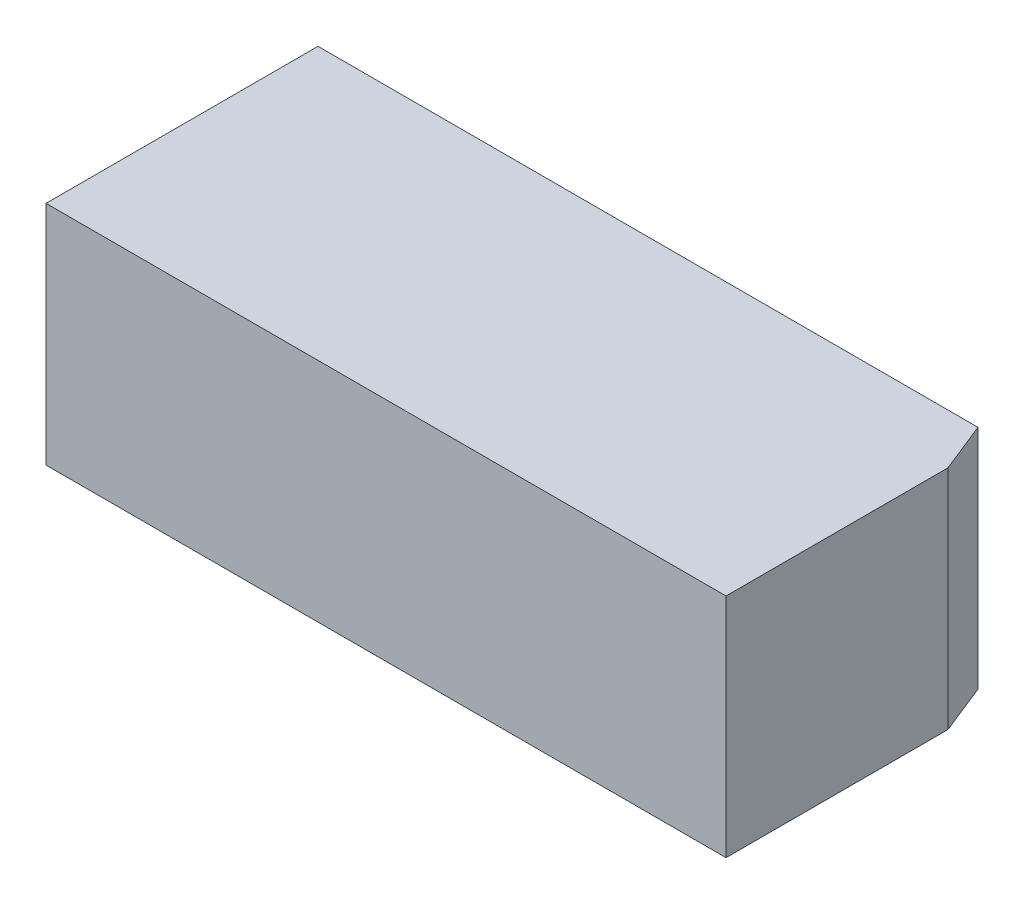
ISO-10303-21;
HEADER;
FILE_DESCRIPTION(('STEP AP214'),'2;1');
FILE_NAME('part.step','',(''),(''),'','','');
FILE_SCHEMA(('AUTOMOTIVE_DESIGN { 1 0 10303 214 1 1 1 1 }'));
ENDSEC;
DATA;
#1=APPLICATION_CONTEXT('core data for automotive mechanical design processes');
#2=APPLICATION_PROTOCOL_DEFINITION('international standard','automotive_design',2000,#1);
#3=PRODUCT_CONTEXT('',#1,'mechanical');
#4=PRODUCT('Part','Part','',(#3));
#5=PRODUCT_RELATED_PRODUCT_CATEGORY('part','',(#4));
#6=PRODUCT_DEFINITION_FORMATION('','',#4);
#7=PRODUCT_DEFINITION_CONTEXT('part definition',#1,'design');
#8=PRODUCT_DEFINITION('design','',#6,#7);
#9=PRODUCT_DEFINITION_SHAPE('','',#8);
#10=(LENGTH_UNIT() NAMED_UNIT(*) SI_UNIT(.MILLI.,.METRE.));
#11=(NAMED_UNIT(*) PLANE_ANGLE_UNIT() SI_UNIT($,.RADIAN.));
#12=(NAMED_UNIT(*) SI_UNIT($,.STERADIAN.) SOLID_ANGLE_UNIT());
#13=UNCERTAINTY_MEASURE_WITH_UNIT(LENGTH_MEASURE(1.E-05),#10,'distance_accuracy_value','');
#14=(GEOMETRIC_REPRESENTATION_CONTEXT(3) GLOBAL_UNCERTAINTY_ASSIGNED_CONTEXT((#13)) GLOBAL_UNIT_ASSIGNED_CONTEXT((#10,
#11,#12)) REPRESENTATION_CONTEXT('',''));
#15=CARTESIAN_POINT('',(0.,0.,0.));
#16=DIRECTION('',(0.,0.,1.));
#17=DIRECTION('',(1.,0.,0.));
#18=AXIS2_PLACEMENT_3D('',#15,#16,#17);
#19=CARTESIAN_POINT('',(-7.5,5.,-3.));
#20=DIRECTION('',(1.,0.,0.));
#21=DIRECTION('',(0.,0.,-1.));
#22=AXIS2_PLACEMENT_3D('',#19,#20,#21);
#23=PLANE('',#22);
#24=DIRECTION('',(0.,0.,1.));
#25=VECTOR('',#24,1.);
#26=CARTESIAN_POINT('',(-7.5,0.,-3.));
#27=LINE('',#26,#25);
#28=CARTESIAN_POINT('',(-7.5,0.,-3.));
#29=VERTEX_POINT('',#28);
#30=CARTESIAN_POINT('',(-7.5,0.,3.));
#31=VERTEX_POINT('',#30);
#32=EDGE_CURVE('E108',#29,#31,#27,.T.);
#33=ORIENTED_EDGE('',*,*,#32,.T.);
#34=DIRECTION('',(0.,-1.,0.));
#35=VECTOR('',#34,1.);
#36=CARTESIAN_POINT('',(-7.5,5.,3.));
#37=LINE('',#36,#35);
#38=CARTESIAN_POINT('',(-7.5,5.,3.));
#39=VERTEX_POINT('',#38);
#40=EDGE_CURVE('E11',#39,#31,#37,.T.);
#41=ORIENTED_EDGE('',*,*,#40,.F.);
#42=DIRECTION('',(0.,0.,1.));
#43=VECTOR('',#42,1.);
#44=CARTESIAN_POINT('',(-7.5,5.,-3.));
#45=LINE('',#44,#43);
#46=CARTESIAN_POINT('',(-7.5,5.,-3.));
#47=VERTEX_POINT('',#46);
#48=EDGE_CURVE('E104',#47,#39,#45,.T.);
#49=ORIENTED_EDGE('',*,*,#48,.F.);
#50=DIRECTION('',(0.,-1.,0.));
#51=VECTOR('',#50,1.);
#52=CARTESIAN_POINT('',(-7.5,5.,-3.));
#53=LINE('',#52,#51);
#54=EDGE_CURVE('E102',#47,#29,#53,.T.);
#55=ORIENTED_EDGE('',*,*,#54,.T.);
#56=EDGE_LOOP('',(#33,#41,#49,#55));
#57=FACE_BOUND('',#56,.T.);
#58=ADVANCED_FACE('F32',(#57),#23,.F.);
#59=CARTESIAN_POINT('',(7.5,5.,3.));
#60=DIRECTION('',(0.,0.,-1.));
#61=DIRECTION('',(-1.,0.,0.));
#62=AXIS2_PLACEMENT_3D('',#59,#60,#61);
#63=PLANE('',#62);
#64=DIRECTION('',(1.,0.,0.));
#65=VECTOR('',#64,1.);
#66=CARTESIAN_POINT('',(7.5,0.,3.));
#67=LINE('',#66,#65);
#68=CARTESIAN_POINT('',(7.5,0.,3.));
#69=VERTEX_POINT('',#68);
#70=EDGE_CURVE('E111',#31,#69,#67,.T.);
#71=ORIENTED_EDGE('',*,*,#70,.T.);
#72=DIRECTION('',(0.,-1.,0.));
#73=VECTOR('',#72,1.);
#74=CARTESIAN_POINT('',(7.5,5.,3.));
#75=LINE('',#74,#73);
#76=CARTESIAN_POINT('',(7.5,5.,3.));
#77=VERTEX_POINT('',#76);
#78=EDGE_CURVE('E39',#77,#69,#75,.T.);
#79=ORIENTED_EDGE('',*,*,#78,.F.);
#80=DIRECTION('',(1.,0.,0.));
#81=VECTOR('',#80,1.);
#82=CARTESIAN_POINT('',(7.5,5.,3.));
#83=LINE('',#82,#81);
#84=EDGE_CURVE('E78',#39,#77,#83,.T.);
#85=ORIENTED_EDGE('',*,*,#84,.F.);
#86=ORIENTED_EDGE('',*,*,#40,.T.);
#87=EDGE_LOOP('',(#71,#79,#85,#86));
#88=FACE_BOUND('',#87,.T.);
#89=ADVANCED_FACE('F148',(#88),#63,.F.);
#90=CARTESIAN_POINT('',(7.5,5.,-3.));
#91=DIRECTION('',(-1.,0.,0.));
#92=DIRECTION('',(0.,0.,1.));
#93=AXIS2_PLACEMENT_3D('',#90,#91,#92);
#94=PLANE('',#93);
#95=DIRECTION('',(0.,0.,-1.));
#96=VECTOR('',#95,1.);
#97=CARTESIAN_POINT('',(7.5,0.,-3.));
#98=LINE('',#97,#96);
#99=CARTESIAN_POINT('',(7.5,0.,-1.89511273784654));
#100=VERTEX_POINT('',#99);
#101=EDGE_CURVE('E98',#69,#100,#98,.T.);
#102=ORIENTED_EDGE('',*,*,#101,.T.);
#103=DIRECTION('',(0.,-1.,0.));
#104=VECTOR('',#103,1.);
#105=CARTESIAN_POINT('',(7.5,5.,-1.89511273784654));
#106=LINE('',#105,#104);
#107=CARTESIAN_POINT('',(7.5,5.,-1.89511273784654));
#108=VERTEX_POINT('',#107);
#109=EDGE_CURVE('E46',#108,#100,#106,.T.);
#110=ORIENTED_EDGE('',*,*,#109,.F.);
#111=DIRECTION('',(0.,0.,-1.));
#112=VECTOR('',#111,1.);
#113=CARTESIAN_POINT('',(7.5,5.,-3.));
#114=LINE('',#113,#112);
#115=EDGE_CURVE('E96',#77,#108,#114,.T.);
#116=ORIENTED_EDGE('',*,*,#115,.F.);
#117=ORIENTED_EDGE('',*,*,#78,.T.);
#118=EDGE_LOOP('',(#102,#110,#116,#117));
#119=FACE_BOUND('',#118,.T.);
#120=ADVANCED_FACE('F94',(#119),#94,.F.);
#121=CARTESIAN_POINT('',(7.5,5.,-3.));
#122=DIRECTION('',(0.,0.,1.));
#123=DIRECTION('',(1.,0.,0.));
#124=AXIS2_PLACEMENT_3D('',#121,#122,#123);
#125=PLANE('',#124);
#126=DIRECTION('',(-1.,0.,0.));
#127=VECTOR('',#126,1.);
#128=CARTESIAN_POINT('',(7.5,5.,-3.));
#129=LINE('',#128,#127);
#130=CARTESIAN_POINT('',(7.05804509513862,5.,-3.));
#131=VERTEX_POINT('',#130);
#132=EDGE_CURVE('E55',#131,#47,#129,.T.);
#133=ORIENTED_EDGE('',*,*,#132,.F.);
#134=DIRECTION('',(0.,-1.,0.));
#135=VECTOR('',#134,1.);
#136=CARTESIAN_POINT('',(7.05804509513862,5.,-3.));
#137=LINE('',#136,#135);
#138=CARTESIAN_POINT('',(7.05804509513862,0.,-3.));
#139=VERTEX_POINT('',#138);
#140=EDGE_CURVE('E87',#131,#139,#137,.T.);
#141=ORIENTED_EDGE('',*,*,#140,.T.);
#142=DIRECTION('',(-1.,0.,0.));
#143=VECTOR('',#142,1.);
#144=CARTESIAN_POINT('',(7.5,0.,-3.));
#145=LINE('',#144,#143);
#146=EDGE_CURVE('E73',#139,#29,#145,.T.);
#147=ORIENTED_EDGE('',*,*,#146,.T.);
#148=ORIENTED_EDGE('',*,*,#54,.F.);
#149=EDGE_LOOP('',(#133,#141,#147,#148));
#150=FACE_BOUND('',#149,.T.);
#151=ADVANCED_FACE('F154',(#150),#125,.F.);
#152=CARTESIAN_POINT('',(0.,5.,0.));
#153=DIRECTION('',(0.,-1.,0.));
#154=DIRECTION('',(0.,0.,-1.));
#155=AXIS2_PLACEMENT_3D('',#152,#153,#154);
#156=PLANE('',#155);
#157=ORIENTED_EDGE('',*,*,#115,.T.);
#158=DIRECTION('',(-0.371390676354104,0.,-0.928476690885259));
#159=VECTOR('',#158,1.);
#160=CARTESIAN_POINT('',(7.05804509513862,5.,-3.));
#161=LINE('',#160,#159);
#162=EDGE_CURVE('E85',#108,#131,#161,.T.);
#163=ORIENTED_EDGE('',*,*,#162,.T.);
#164=ORIENTED_EDGE('',*,*,#132,.T.);
#165=ORIENTED_EDGE('',*,*,#48,.T.);
#166=ORIENTED_EDGE('',*,*,#84,.T.);
#167=EDGE_LOOP('',(#157,#163,#164,#165,#166));
#168=FACE_BOUND('',#167,.T.);
#169=ADVANCED_FACE('F100',(#168),#156,.F.);
#170=CARTESIAN_POINT('',(0.,0.,0.));
#171=DIRECTION('',(0.,-1.,0.));
#172=DIRECTION('',(0.,0.,-1.));
#173=AXIS2_PLACEMENT_3D('',#170,#171,#172);
#174=PLANE('',#173);
#175=DIRECTION('',(-0.371390676354104,0.,-0.928476690885259));
#176=VECTOR('',#175,1.);
#177=CARTESIAN_POINT('',(7.05804509513862,0.,-3.));
#178=LINE('',#177,#176);
#179=EDGE_CURVE('E89',#100,#139,#178,.T.);
#180=ORIENTED_EDGE('',*,*,#179,.F.);
#181=ORIENTED_EDGE('',*,*,#101,.F.);
#182=ORIENTED_EDGE('',*,*,#70,.F.);
#183=ORIENTED_EDGE('',*,*,#32,.F.);
#184=ORIENTED_EDGE('',*,*,#146,.F.);
#185=EDGE_LOOP('',(#180,#181,#182,#183,#184));
#186=FACE_BOUND('',#185,.T.);
#187=CARTESIAN_POINT('',(2.5,0.,0.));
#188=DIRECTION('',(0.,-1.,0.));
#189=DIRECTION('',(0.,0.,-1.));
#190=AXIS2_PLACEMENT_3D('',#187,#188,#189);
#191=CIRCLE('',#190,0.795000000000002);
#192=CARTESIAN_POINT('',(2.5,0.,-0.795000000000001));
#193=VERTEX_POINT('',#192);
#194=EDGE_CURVE('E122',#193,#193,#191,.T.);
#195=ORIENTED_EDGE('',*,*,#194,.F.);
#196=EDGE_LOOP('',(#195));
#197=FACE_BOUND('',#196,.T.);
#198=CARTESIAN_POINT('',(-6.25,0.,1.875));
#199=DIRECTION('',(0.,-1.,0.));
#200=DIRECTION('',(0.,0.,-1.));
#201=AXIS2_PLACEMENT_3D('',#198,#199,#200);
#202=CIRCLE('',#201,0.795000000000002);
#203=CARTESIAN_POINT('',(-6.25,0.,1.08));
#204=VERTEX_POINT('',#203);
#205=EDGE_CURVE('E127',#204,#204,#202,.T.);
#206=ORIENTED_EDGE('',*,*,#205,.F.);
#207=EDGE_LOOP('',(#206));
#208=FACE_BOUND('',#207,.T.);
#209=CARTESIAN_POINT('',(-6.25,0.,-1.875));
#210=DIRECTION('',(0.,-1.,0.));
#211=DIRECTION('',(0.,0.,-1.));
#212=AXIS2_PLACEMENT_3D('',#209,#210,#211);
#213=CIRCLE('',#212,0.795000000000001);
#214=CARTESIAN_POINT('',(-6.25,0.,-2.67));
#215=VERTEX_POINT('',#214);
#216=EDGE_CURVE('E133',#215,#215,#213,.T.);
#217=ORIENTED_EDGE('',*,*,#216,.F.);
#218=EDGE_LOOP('',(#217));
#219=FACE_BOUND('',#218,.T.);
#220=CARTESIAN_POINT('',(-4.5,0.,0.));
#221=DIRECTION('',(0.,-1.,0.));
#222=DIRECTION('',(0.,0.,-1.));
#223=AXIS2_PLACEMENT_3D('',#220,#221,#222);
#224=CIRCLE('',#223,1.25);
#225=CARTESIAN_POINT('',(-4.5,0.,-1.25));
#226=VERTEX_POINT('',#225);
#227=EDGE_CURVE('E139',#226,#226,#224,.T.);
#228=ORIENTED_EDGE('',*,*,#227,.F.);
#229=EDGE_LOOP('',(#228));
#230=FACE_BOUND('',#229,.T.);
#231=ADVANCED_FACE('F117',(#186,#197,#208,#219,#230),#174,.T.);
#232=CARTESIAN_POINT('',(-4.5,4.,0.));
#233=DIRECTION('',(0.,-1.,0.));
#234=DIRECTION('',(0.,0.,-1.));
#235=AXIS2_PLACEMENT_3D('',#232,#233,#234);
#236=CYLINDRICAL_SURFACE('',#235,1.25);
#237=CARTESIAN_POINT('',(-4.5,4.,0.));
#238=DIRECTION('',(0.,-1.,0.));
#239=DIRECTION('',(0.,0.,-1.));
#240=AXIS2_PLACEMENT_3D('',#237,#238,#239);
#241=CIRCLE('',#240,1.25);
#242=CARTESIAN_POINT('',(-4.5,4.,-1.25));
#243=VERTEX_POINT('',#242);
#244=EDGE_CURVE('E112',#243,#243,#241,.T.);
#245=ORIENTED_EDGE('',*,*,#244,.F.);
#246=EDGE_LOOP('',(#245));
#247=FACE_BOUND('',#246,.T.);
#248=ORIENTED_EDGE('',*,*,#227,.T.);
#249=EDGE_LOOP('',(#248));
#250=FACE_BOUND('',#249,.T.);
#251=ADVANCED_FACE('F161',(#247,#250),#236,.F.);
#252=CARTESIAN_POINT('',(-4.5,4.,0.));
#253=DIRECTION('',(0.,-1.,0.));
#254=DIRECTION('',(0.,0.,-1.));
#255=AXIS2_PLACEMENT_3D('',#252,#253,#254);
#256=PLANE('',#255);
#257=ORIENTED_EDGE('',*,*,#244,.T.);
#258=EDGE_LOOP('',(#257));
#259=FACE_BOUND('',#258,.T.);
#260=ADVANCED_FACE('F166',(#259),#256,.T.);
#261=CARTESIAN_POINT('',(-6.25,1.,-1.875));
#262=DIRECTION('',(0.,-1.,0.));
#263=DIRECTION('',(0.,0.,-1.));
#264=AXIS2_PLACEMENT_3D('',#261,#262,#263);
#265=CYLINDRICAL_SURFACE('',#264,0.795000000000001);
#266=CARTESIAN_POINT('',(-6.25,1.,-1.875));
#267=DIRECTION('',(0.,-1.,0.));
#268=DIRECTION('',(0.,0.,-1.));
#269=AXIS2_PLACEMENT_3D('',#266,#267,#268);
#270=CIRCLE('',#269,0.795000000000001);
#271=CARTESIAN_POINT('',(-6.25,1.,-2.67));
#272=VERTEX_POINT('',#271);
#273=EDGE_CURVE('E136',#272,#272,#270,.T.);
#274=ORIENTED_EDGE('',*,*,#273,.F.);
#275=EDGE_LOOP('',(#274));
#276=FACE_BOUND('',#275,.T.);
#277=ORIENTED_EDGE('',*,*,#216,.T.);
#278=EDGE_LOOP('',(#277));
#279=FACE_BOUND('',#278,.T.);
#280=ADVANCED_FACE('F170',(#276,#279),#265,.F.);
#281=CARTESIAN_POINT('',(-6.25,1.,-1.875));
#282=DIRECTION('',(0.,-1.,0.));
#283=DIRECTION('',(0.,0.,-1.));
#284=AXIS2_PLACEMENT_3D('',#281,#282,#283);
#285=PLANE('',#284);
#286=ORIENTED_EDGE('',*,*,#273,.T.);
#287=EDGE_LOOP('',(#286));
#288=FACE_BOUND('',#287,.T.);
#289=ADVANCED_FACE('F174',(#288),#285,.T.);
#290=CARTESIAN_POINT('',(-6.25,1.,1.875));
#291=DIRECTION('',(0.,-1.,0.));
#292=DIRECTION('',(0.,0.,-1.));
#293=AXIS2_PLACEMENT_3D('',#290,#291,#292);
#294=CYLINDRICAL_SURFACE('',#293,0.795000000000002);
#295=CARTESIAN_POINT('',(-6.25,1.,1.875));
#296=DIRECTION('',(0.,-1.,0.));
#297=DIRECTION('',(0.,0.,-1.));
#298=AXIS2_PLACEMENT_3D('',#295,#296,#297);
#299=CIRCLE('',#298,0.795000000000002);
#300=CARTESIAN_POINT('',(-6.25,1.,1.08));
#301=VERTEX_POINT('',#300);
#302=EDGE_CURVE('E130',#301,#301,#299,.T.);
#303=ORIENTED_EDGE('',*,*,#302,.F.);
#304=EDGE_LOOP('',(#303));
#305=FACE_BOUND('',#304,.T.);
#306=ORIENTED_EDGE('',*,*,#205,.T.);
#307=EDGE_LOOP('',(#306));
#308=FACE_BOUND('',#307,.T.);
#309=ADVANCED_FACE('F178',(#305,#308),#294,.F.);
#310=CARTESIAN_POINT('',(-6.25,1.,1.875));
#311=DIRECTION('',(0.,-1.,0.));
#312=DIRECTION('',(0.,0.,-1.));
#313=AXIS2_PLACEMENT_3D('',#310,#311,#312);
#314=PLANE('',#313);
#315=ORIENTED_EDGE('',*,*,#302,.T.);
#316=EDGE_LOOP('',(#315));
#317=FACE_BOUND('',#316,.T.);
#318=ADVANCED_FACE('F182',(#317),#314,.T.);
#319=CARTESIAN_POINT('',(2.5,1.,0.));
#320=DIRECTION('',(0.,-1.,0.));
#321=DIRECTION('',(0.,0.,-1.));
#322=AXIS2_PLACEMENT_3D('',#319,#320,#321);
#323=CYLINDRICAL_SURFACE('',#322,0.795000000000002);
#324=CARTESIAN_POINT('',(2.5,1.,0.));
#325=DIRECTION('',(0.,-1.,0.));
#326=DIRECTION('',(0.,0.,-1.));
#327=AXIS2_PLACEMENT_3D('',#324,#325,#326);
#328=CIRCLE('',#327,0.795000000000002);
#329=CARTESIAN_POINT('',(2.5,1.,-0.795000000000001));
#330=VERTEX_POINT('',#329);
#331=EDGE_CURVE('E124',#330,#330,#328,.T.);
#332=ORIENTED_EDGE('',*,*,#331,.F.);
#333=EDGE_LOOP('',(#332));
#334=FACE_BOUND('',#333,.T.);
#335=ORIENTED_EDGE('',*,*,#194,.T.);
#336=EDGE_LOOP('',(#335));
#337=FACE_BOUND('',#336,.T.);
#338=ADVANCED_FACE('F186',(#334,#337),#323,.F.);
#339=CARTESIAN_POINT('',(2.5,1.,0.));
#340=DIRECTION('',(0.,-1.,0.));
#341=DIRECTION('',(0.,0.,-1.));
#342=AXIS2_PLACEMENT_3D('',#339,#340,#341);
#343=PLANE('',#342);
#344=ORIENTED_EDGE('',*,*,#331,.T.);
#345=EDGE_LOOP('',(#344));
#346=FACE_BOUND('',#345,.T.);
#347=ADVANCED_FACE('F190',(#346),#343,.T.);
#348=CARTESIAN_POINT('',(7.05804509513862,5.,-3.));
#349=DIRECTION('',(-0.928476690885259,0.,0.371390676354104));
#350=DIRECTION('',(0.371390676354104,0.,0.928476690885259));
#351=AXIS2_PLACEMENT_3D('',#348,#349,#350);
#352=PLANE('',#351);
#353=ORIENTED_EDGE('',*,*,#179,.T.);
#354=ORIENTED_EDGE('',*,*,#140,.F.);
#355=ORIENTED_EDGE('',*,*,#162,.F.);
#356=ORIENTED_EDGE('',*,*,#109,.T.);
#357=EDGE_LOOP('',(#353,#354,#355,#356));
#358=FACE_BOUND('',#357,.T.);
#359=ADVANCED_FACE('F86',(#358),#352,.F.);
#360=CLOSED_SHELL('',(#58,#89,#120,#151,#169,#231,#251,#260,#280,#289,#309,#318,#338,#347,#359));
#361=MANIFOLD_SOLID_BREP('B2',#360);
#362=ADVANCED_BREP_SHAPE_REPRESENTATION('',(#18,#361),#14);
#363=SHAPE_DEFINITION_REPRESENTATION(#9,#362);
ENDSEC;
END-ISO-10303-21;
